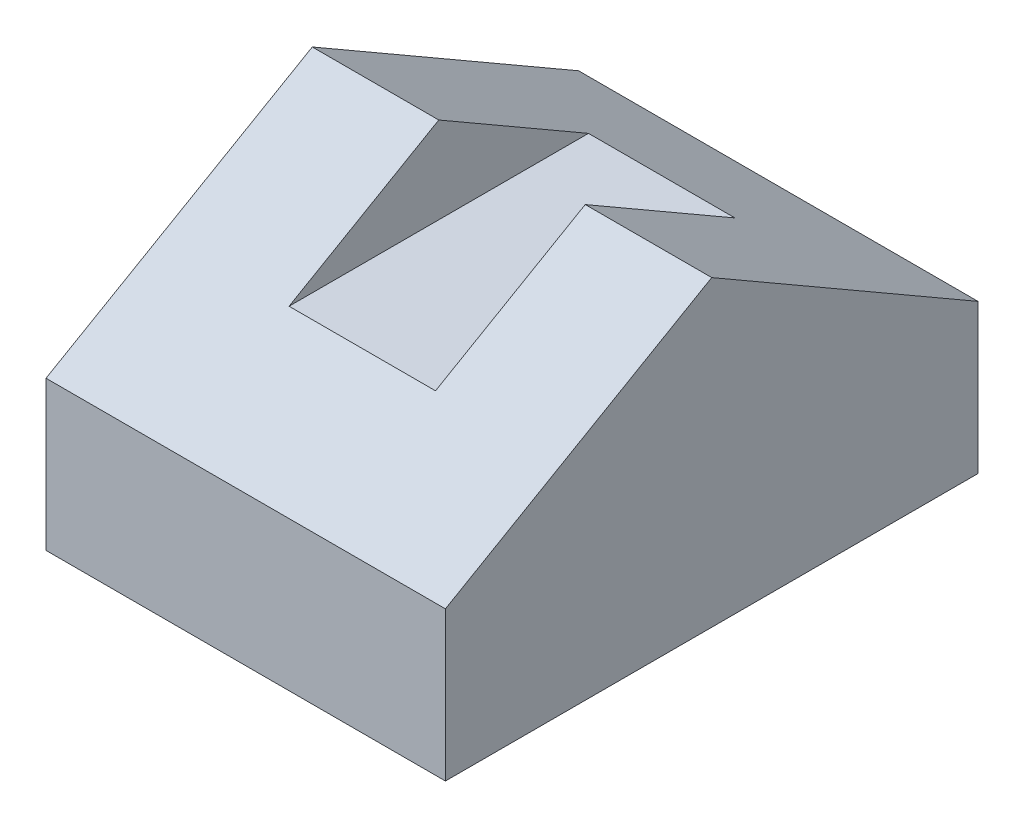
ISO-10303-21;
HEADER;
FILE_DESCRIPTION(('STEP AP214'),'2;1');
FILE_NAME('part.step','',(''),(''),'','','');
FILE_SCHEMA(('AUTOMOTIVE_DESIGN { 1 0 10303 214 1 1 1 1 }'));
ENDSEC;
DATA;
#1=APPLICATION_CONTEXT('core data for automotive mechanical design processes');
#2=APPLICATION_PROTOCOL_DEFINITION('international standard','automotive_design',2000,#1);
#3=PRODUCT_CONTEXT('',#1,'mechanical');
#4=PRODUCT('Part','Part','',(#3));
#5=PRODUCT_RELATED_PRODUCT_CATEGORY('part','',(#4));
#6=PRODUCT_DEFINITION_FORMATION('','',#4);
#7=PRODUCT_DEFINITION_CONTEXT('part definition',#1,'design');
#8=PRODUCT_DEFINITION('design','',#6,#7);
#9=PRODUCT_DEFINITION_SHAPE('','',#8);
#10=(LENGTH_UNIT() NAMED_UNIT(*) SI_UNIT(.MILLI.,.METRE.));
#11=(NAMED_UNIT(*) PLANE_ANGLE_UNIT() SI_UNIT($,.RADIAN.));
#12=(NAMED_UNIT(*) SI_UNIT($,.STERADIAN.) SOLID_ANGLE_UNIT());
#13=UNCERTAINTY_MEASURE_WITH_UNIT(LENGTH_MEASURE(1.E-05),#10,'distance_accuracy_value','');
#14=(GEOMETRIC_REPRESENTATION_CONTEXT(3) GLOBAL_UNCERTAINTY_ASSIGNED_CONTEXT((#13)) GLOBAL_UNIT_ASSIGNED_CONTEXT((#10,
#11,#12)) REPRESENTATION_CONTEXT('',''));
#15=CARTESIAN_POINT('',(0.,0.,0.));
#16=DIRECTION('',(0.,0.,1.));
#17=DIRECTION('',(1.,0.,0.));
#18=AXIS2_PLACEMENT_3D('',#15,#16,#17);
#19=CARTESIAN_POINT('',(0.15,0.,-0.0999999999999994));
#20=DIRECTION('',(0.,0.,1.));
#21=DIRECTION('',(1.,0.,0.));
#22=AXIS2_PLACEMENT_3D('',#19,#20,#21);
#23=PLANE('',#22);
#24=DIRECTION('',(0.,1.,0.));
#25=VECTOR('',#24,1.);
#26=CARTESIAN_POINT('',(0.,0.,-0.0999999999999994));
#27=LINE('',#26,#25);
#28=CARTESIAN_POINT('',(0.,0.,-0.0999999999999994));
#29=VERTEX_POINT('',#28);
#30=CARTESIAN_POINT('',(0.,0.0559999999999996,-0.0999999999999994));
#31=VERTEX_POINT('',#30);
#32=EDGE_CURVE('E122',#29,#31,#27,.T.);
#33=ORIENTED_EDGE('',*,*,#32,.T.);
#34=DIRECTION('',(-1.,0.,0.));
#35=VECTOR('',#34,1.);
#36=CARTESIAN_POINT('',(0.15,0.0559999999999996,-0.0999999999999994));
#37=LINE('',#36,#35);
#38=CARTESIAN_POINT('',(0.15,0.0559999999999996,-0.0999999999999994));
#39=VERTEX_POINT('',#38);
#40=EDGE_CURVE('E138',#39,#31,#37,.T.);
#41=ORIENTED_EDGE('',*,*,#40,.F.);
#42=DIRECTION('',(0.,1.,0.));
#43=VECTOR('',#42,1.);
#44=CARTESIAN_POINT('',(0.15,0.,-0.0999999999999994));
#45=LINE('',#44,#43);
#46=CARTESIAN_POINT('',(0.15,0.,-0.0999999999999994));
#47=VERTEX_POINT('',#46);
#48=EDGE_CURVE('E133',#47,#39,#45,.T.);
#49=ORIENTED_EDGE('',*,*,#48,.F.);
#50=DIRECTION('',(-1.,0.,0.));
#51=VECTOR('',#50,1.);
#52=CARTESIAN_POINT('',(0.15,0.,-0.0999999999999994));
#53=LINE('',#52,#51);
#54=EDGE_CURVE('E118',#47,#29,#53,.T.);
#55=ORIENTED_EDGE('',*,*,#54,.T.);
#56=EDGE_LOOP('',(#33,#41,#49,#55));
#57=FACE_BOUND('',#56,.T.);
#58=ADVANCED_FACE('F35',(#57),#23,.F.);
#59=CARTESIAN_POINT('',(0.15,0.0559999999999996,-0.0999999999999994));
#60=DIRECTION('',(0.,-0.866025403784445,0.49999999999999));
#61=DIRECTION('',(0.,-0.49999999999999,-0.866025403784445));
#62=AXIS2_PLACEMENT_3D('',#59,#60,#61);
#63=PLANE('',#62);
#64=DIRECTION('',(1.,0.,0.));
#65=VECTOR('',#64,1.);
#66=CARTESIAN_POINT('',(0.15,0.0812750269189604,-0.0562223692136871));
#67=LINE('',#66,#65);
#68=CARTESIAN_POINT('',(0.0475,0.0812750269189603,-0.0562223692136872));
#69=VERTEX_POINT('',#68);
#70=CARTESIAN_POINT('',(0.1025,0.0812750269189604,-0.0562223692136872));
#71=VERTEX_POINT('',#70);
#72=EDGE_CURVE('E164',#69,#71,#67,.T.);
#73=ORIENTED_EDGE('',*,*,#72,.T.);
#74=DIRECTION('',(0.,0.49999999999999,0.866025403784445));
#75=VECTOR('',#74,1.);
#76=CARTESIAN_POINT('',(0.1025,0.0559999999999996,-0.0999999999999994));
#77=LINE('',#76,#75);
#78=CARTESIAN_POINT('',(0.1025,0.11373502691896,0.));
#79=VERTEX_POINT('',#78);
#80=EDGE_CURVE('E126',#71,#79,#77,.T.);
#81=ORIENTED_EDGE('',*,*,#80,.T.);
#82=DIRECTION('',(-1.,0.,0.));
#83=VECTOR('',#82,1.);
#84=CARTESIAN_POINT('',(0.15,0.11373502691896,0.));
#85=LINE('',#84,#83);
#86=CARTESIAN_POINT('',(0.15,0.11373502691896,0.));
#87=VERTEX_POINT('',#86);
#88=EDGE_CURVE('E136',#87,#79,#85,.T.);
#89=ORIENTED_EDGE('',*,*,#88,.F.);
#90=DIRECTION('',(0.,0.49999999999999,0.866025403784444));
#91=VECTOR('',#90,1.);
#92=CARTESIAN_POINT('',(0.15,0.0559999999999996,-0.0999999999999994));
#93=LINE('',#92,#91);
#94=EDGE_CURVE('E91',#39,#87,#93,.T.);
#95=ORIENTED_EDGE('',*,*,#94,.F.);
#96=ORIENTED_EDGE('',*,*,#40,.T.);
#97=DIRECTION('',(0.,0.49999999999999,0.866025403784444));
#98=VECTOR('',#97,1.);
#99=CARTESIAN_POINT('',(0.,0.0559999999999996,-0.0999999999999994));
#100=LINE('',#99,#98);
#101=CARTESIAN_POINT('',(0.,0.11373502691896,0.));
#102=VERTEX_POINT('',#101);
#103=EDGE_CURVE('E125',#31,#102,#100,.T.);
#104=ORIENTED_EDGE('',*,*,#103,.T.);
#105=CARTESIAN_POINT('',(0.0475,0.11373502691896,0.));
#106=VERTEX_POINT('',#105);
#107=EDGE_CURVE('E113',#106,#102,#85,.T.);
#108=ORIENTED_EDGE('',*,*,#107,.F.);
#109=DIRECTION('',(0.,-0.49999999999999,-0.866025403784445));
#110=VECTOR('',#109,1.);
#111=CARTESIAN_POINT('',(0.0475,0.0559999999999996,-0.0999999999999994));
#112=LINE('',#111,#110);
#113=EDGE_CURVE('E49',#106,#69,#112,.T.);
#114=ORIENTED_EDGE('',*,*,#113,.T.);
#115=EDGE_LOOP('',(#73,#81,#89,#95,#96,#104,#108,#114));
#116=FACE_BOUND('',#115,.T.);
#117=ADVANCED_FACE('F174',(#116),#63,.F.);
#118=CARTESIAN_POINT('',(0.15,0.11373502691896,0.));
#119=DIRECTION('',(0.,-0.866025403784443,-0.499999999999993));
#120=DIRECTION('',(0.,0.499999999999993,-0.866025403784443));
#121=AXIS2_PLACEMENT_3D('',#118,#119,#120);
#122=PLANE('',#121);
#123=ORIENTED_EDGE('',*,*,#88,.T.);
#124=DIRECTION('',(0.,-0.499999999999993,0.866025403784443));
#125=VECTOR('',#124,1.);
#126=CARTESIAN_POINT('',(0.1025,0.11373502691896,0.));
#127=LINE('',#126,#125);
#128=CARTESIAN_POINT('',(0.1025,0.0812750269189604,0.0562223692136869));
#129=VERTEX_POINT('',#128);
#130=EDGE_CURVE('E11',#79,#129,#127,.T.);
#131=ORIENTED_EDGE('',*,*,#130,.T.);
#132=DIRECTION('',(-1.,0.,0.));
#133=VECTOR('',#132,1.);
#134=CARTESIAN_POINT('',(0.15,0.0812750269189604,0.0562223692136869));
#135=LINE('',#134,#133);
#136=CARTESIAN_POINT('',(0.0475,0.0812750269189604,0.0562223692136869));
#137=VERTEX_POINT('',#136);
#138=EDGE_CURVE('E42',#129,#137,#135,.T.);
#139=ORIENTED_EDGE('',*,*,#138,.T.);
#140=DIRECTION('',(0.,0.499999999999993,-0.866025403784443));
#141=VECTOR('',#140,1.);
#142=CARTESIAN_POINT('',(0.0475,0.11373502691896,0.));
#143=LINE('',#142,#141);
#144=EDGE_CURVE('E140',#137,#106,#143,.T.);
#145=ORIENTED_EDGE('',*,*,#144,.T.);
#146=ORIENTED_EDGE('',*,*,#107,.T.);
#147=DIRECTION('',(0.,-0.499999999999993,0.866025403784443));
#148=VECTOR('',#147,1.);
#149=CARTESIAN_POINT('',(0.,0.11373502691896,0.));
#150=LINE('',#149,#148);
#151=CARTESIAN_POINT('',(0.,0.0559999999999993,0.0999999999999994));
#152=VERTEX_POINT('',#151);
#153=EDGE_CURVE('E110',#102,#152,#150,.T.);
#154=ORIENTED_EDGE('',*,*,#153,.T.);
#155=DIRECTION('',(-1.,0.,0.));
#156=VECTOR('',#155,1.);
#157=CARTESIAN_POINT('',(0.15,0.0559999999999993,0.0999999999999994));
#158=LINE('',#157,#156);
#159=CARTESIAN_POINT('',(0.15,0.0559999999999993,0.0999999999999994));
#160=VERTEX_POINT('',#159);
#161=EDGE_CURVE('E107',#160,#152,#158,.T.);
#162=ORIENTED_EDGE('',*,*,#161,.F.);
#163=DIRECTION('',(0.,-0.499999999999993,0.866025403784443));
#164=VECTOR('',#163,1.);
#165=CARTESIAN_POINT('',(0.15,0.11373502691896,0.));
#166=LINE('',#165,#164);
#167=EDGE_CURVE('E97',#87,#160,#166,.T.);
#168=ORIENTED_EDGE('',*,*,#167,.F.);
#169=EDGE_LOOP('',(#123,#131,#139,#145,#146,#154,#162,#168));
#170=FACE_BOUND('',#169,.T.);
#171=ADVANCED_FACE('F108',(#170),#122,.F.);
#172=CARTESIAN_POINT('',(0.15,0.0559999999999993,0.0999999999999994));
#173=DIRECTION('',(0.,0.,-1.));
#174=DIRECTION('',(-1.,0.,0.));
#175=AXIS2_PLACEMENT_3D('',#172,#173,#174);
#176=PLANE('',#175);
#177=DIRECTION('',(0.,-1.,0.));
#178=VECTOR('',#177,1.);
#179=CARTESIAN_POINT('',(0.,0.0559999999999993,0.0999999999999994));
#180=LINE('',#179,#178);
#181=CARTESIAN_POINT('',(0.,0.,0.0999999999999994));
#182=VERTEX_POINT('',#181);
#183=EDGE_CURVE('E130',#152,#182,#180,.T.);
#184=ORIENTED_EDGE('',*,*,#183,.T.);
#185=DIRECTION('',(-1.,0.,0.));
#186=VECTOR('',#185,1.);
#187=CARTESIAN_POINT('',(0.15,0.,0.0999999999999994));
#188=LINE('',#187,#186);
#189=CARTESIAN_POINT('',(0.15,0.,0.0999999999999994));
#190=VERTEX_POINT('',#189);
#191=EDGE_CURVE('E114',#190,#182,#188,.T.);
#192=ORIENTED_EDGE('',*,*,#191,.F.);
#193=DIRECTION('',(0.,-1.,0.));
#194=VECTOR('',#193,1.);
#195=CARTESIAN_POINT('',(0.15,0.0559999999999993,0.0999999999999994));
#196=LINE('',#195,#194);
#197=EDGE_CURVE('E101',#160,#190,#196,.T.);
#198=ORIENTED_EDGE('',*,*,#197,.F.);
#199=ORIENTED_EDGE('',*,*,#161,.T.);
#200=EDGE_LOOP('',(#184,#192,#198,#199));
#201=FACE_BOUND('',#200,.T.);
#202=ADVANCED_FACE('F116',(#201),#176,.F.);
#203=CARTESIAN_POINT('',(0.15,0.,0.0999999999999994));
#204=DIRECTION('',(0.,1.,0.));
#205=DIRECTION('',(0.,0.,1.));
#206=AXIS2_PLACEMENT_3D('',#203,#204,#205);
#207=PLANE('',#206);
#208=DIRECTION('',(0.,0.,-1.));
#209=VECTOR('',#208,1.);
#210=CARTESIAN_POINT('',(0.,0.,0.0999999999999994));
#211=LINE('',#210,#209);
#212=EDGE_CURVE('E82',#182,#29,#211,.T.);
#213=ORIENTED_EDGE('',*,*,#212,.T.);
#214=ORIENTED_EDGE('',*,*,#54,.F.);
#215=DIRECTION('',(0.,0.,-1.));
#216=VECTOR('',#215,1.);
#217=CARTESIAN_POINT('',(0.15,0.,0.0999999999999994));
#218=LINE('',#217,#216);
#219=EDGE_CURVE('E58',#190,#47,#218,.T.);
#220=ORIENTED_EDGE('',*,*,#219,.F.);
#221=ORIENTED_EDGE('',*,*,#191,.T.);
#222=EDGE_LOOP('',(#213,#214,#220,#221));
#223=FACE_BOUND('',#222,.T.);
#224=ADVANCED_FACE('F177',(#223),#207,.F.);
#225=CARTESIAN_POINT('',(0.15,0.,0.));
#226=DIRECTION('',(-1.,0.,0.));
#227=DIRECTION('',(0.,0.,1.));
#228=AXIS2_PLACEMENT_3D('',#225,#226,#227);
#229=PLANE('',#228);
#230=ORIENTED_EDGE('',*,*,#48,.T.);
#231=ORIENTED_EDGE('',*,*,#94,.T.);
#232=ORIENTED_EDGE('',*,*,#167,.T.);
#233=ORIENTED_EDGE('',*,*,#197,.T.);
#234=ORIENTED_EDGE('',*,*,#219,.T.);
#235=EDGE_LOOP('',(#230,#231,#232,#233,#234));
#236=FACE_BOUND('',#235,.T.);
#237=ADVANCED_FACE('F99',(#236),#229,.F.);
#238=CARTESIAN_POINT('',(0.,0.,0.));
#239=DIRECTION('',(-1.,0.,0.));
#240=DIRECTION('',(0.,0.,1.));
#241=AXIS2_PLACEMENT_3D('',#238,#239,#240);
#242=PLANE('',#241);
#243=ORIENTED_EDGE('',*,*,#32,.F.);
#244=ORIENTED_EDGE('',*,*,#212,.F.);
#245=ORIENTED_EDGE('',*,*,#183,.F.);
#246=ORIENTED_EDGE('',*,*,#153,.F.);
#247=ORIENTED_EDGE('',*,*,#103,.F.);
#248=EDGE_LOOP('',(#243,#244,#245,#246,#247));
#249=FACE_BOUND('',#248,.T.);
#250=ADVANCED_FACE('F176',(#249),#242,.T.);
#251=CARTESIAN_POINT('',(0.1025,0.0812750269189604,-0.0999999999999994));
#252=DIRECTION('',(1.,0.,0.));
#253=DIRECTION('',(0.,1.,0.));
#254=AXIS2_PLACEMENT_3D('',#251,#252,#253);
#255=PLANE('',#254);
#256=DIRECTION('',(0.,0.,1.));
#257=VECTOR('',#256,1.);
#258=CARTESIAN_POINT('',(0.1025,0.0812750269189604,-0.0999999999999994));
#259=LINE('',#258,#257);
#260=EDGE_CURVE('E155',#71,#129,#259,.T.);
#261=ORIENTED_EDGE('',*,*,#260,.T.);
#262=ORIENTED_EDGE('',*,*,#130,.F.);
#263=ORIENTED_EDGE('',*,*,#80,.F.);
#264=EDGE_LOOP('',(#261,#262,#263));
#265=FACE_BOUND('',#264,.T.);
#266=ADVANCED_FACE('F160',(#265),#255,.F.);
#267=CARTESIAN_POINT('',(0.0475,0.0812750269189603,-0.0999999999999994));
#268=DIRECTION('',(0.,-1.,0.));
#269=DIRECTION('',(1.,0.,0.));
#270=AXIS2_PLACEMENT_3D('',#267,#268,#269);
#271=PLANE('',#270);
#272=DIRECTION('',(0.,0.,1.));
#273=VECTOR('',#272,1.);
#274=CARTESIAN_POINT('',(0.0475,0.0812750269189603,-0.0999999999999994));
#275=LINE('',#274,#273);
#276=EDGE_CURVE('E157',#69,#137,#275,.T.);
#277=ORIENTED_EDGE('',*,*,#276,.T.);
#278=ORIENTED_EDGE('',*,*,#138,.F.);
#279=ORIENTED_EDGE('',*,*,#260,.F.);
#280=ORIENTED_EDGE('',*,*,#72,.F.);
#281=EDGE_LOOP('',(#277,#278,#279,#280));
#282=FACE_BOUND('',#281,.T.);
#283=ADVANCED_FACE('F153',(#282),#271,.F.);
#284=CARTESIAN_POINT('',(0.0475,0.11373502691896,-0.0999999999999994));
#285=DIRECTION('',(-1.,0.,0.));
#286=DIRECTION('',(0.,-1.,0.));
#287=AXIS2_PLACEMENT_3D('',#284,#285,#286);
#288=PLANE('',#287);
#289=ORIENTED_EDGE('',*,*,#144,.F.);
#290=ORIENTED_EDGE('',*,*,#276,.F.);
#291=ORIENTED_EDGE('',*,*,#113,.F.);
#292=EDGE_LOOP('',(#289,#290,#291));
#293=FACE_BOUND('',#292,.T.);
#294=ADVANCED_FACE('F242',(#293),#288,.F.);
#295=CLOSED_SHELL('',(#58,#117,#171,#202,#224,#237,#250,#266,#283,#294));
#296=MANIFOLD_SOLID_BREP('B2',#295);
#297=ADVANCED_BREP_SHAPE_REPRESENTATION('',(#18,#296),#14);
#298=SHAPE_DEFINITION_REPRESENTATION(#9,#297);
ENDSEC;
END-ISO-10303-21;
